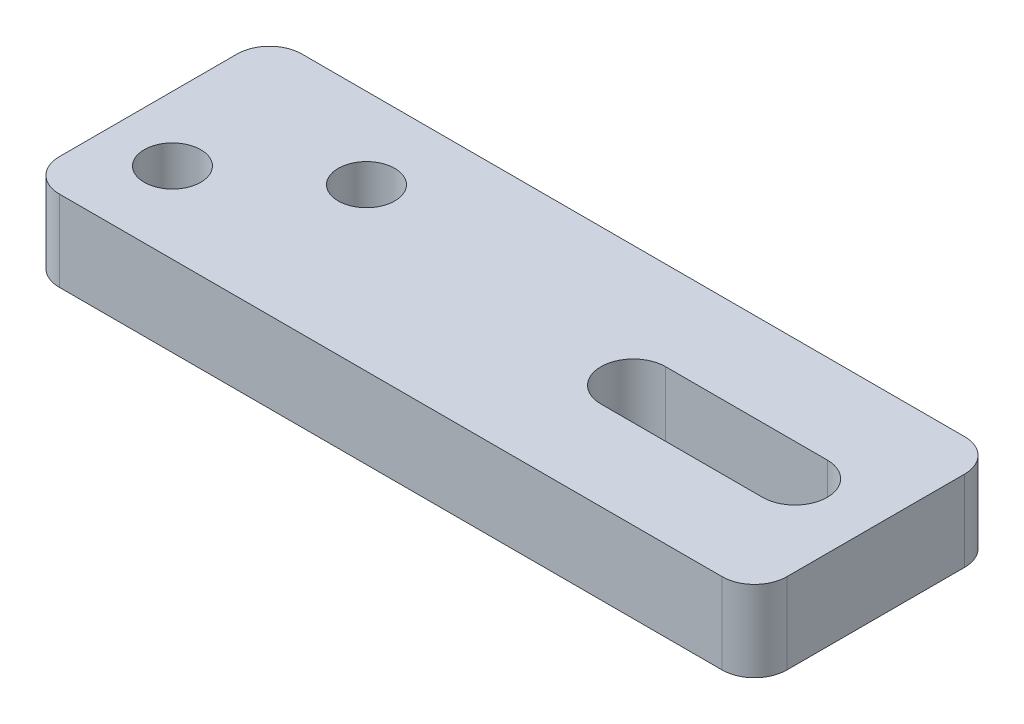
ISO-10303-21;
HEADER;
FILE_DESCRIPTION(('STEP AP214'),'2;1');
FILE_NAME('part.step','',(''),(''),'','','');
FILE_SCHEMA(('AUTOMOTIVE_DESIGN { 1 0 10303 214 1 1 1 1 }'));
ENDSEC;
DATA;
#1=APPLICATION_CONTEXT('core data for automotive mechanical design processes');
#2=APPLICATION_PROTOCOL_DEFINITION('international standard','automotive_design',2000,#1);
#3=PRODUCT_CONTEXT('',#1,'mechanical');
#4=PRODUCT('Part','Part','',(#3));
#5=PRODUCT_RELATED_PRODUCT_CATEGORY('part','',(#4));
#6=PRODUCT_DEFINITION_FORMATION('','',#4);
#7=PRODUCT_DEFINITION_CONTEXT('part definition',#1,'design');
#8=PRODUCT_DEFINITION('design','',#6,#7);
#9=PRODUCT_DEFINITION_SHAPE('','',#8);
#10=(LENGTH_UNIT() NAMED_UNIT(*) SI_UNIT(.MILLI.,.METRE.));
#11=(NAMED_UNIT(*) PLANE_ANGLE_UNIT() SI_UNIT($,.RADIAN.));
#12=(NAMED_UNIT(*) SI_UNIT($,.STERADIAN.) SOLID_ANGLE_UNIT());
#13=UNCERTAINTY_MEASURE_WITH_UNIT(LENGTH_MEASURE(1.E-05),#10,'distance_accuracy_value','');
#14=(GEOMETRIC_REPRESENTATION_CONTEXT(3) GLOBAL_UNCERTAINTY_ASSIGNED_CONTEXT((#13)) GLOBAL_UNIT_ASSIGNED_CONTEXT((#10,
#11,#12)) REPRESENTATION_CONTEXT('',''));
#15=CARTESIAN_POINT('',(0.,0.,0.));
#16=DIRECTION('',(0.,0.,1.));
#17=DIRECTION('',(1.,0.,0.));
#18=AXIS2_PLACEMENT_3D('',#15,#16,#17);
#19=CARTESIAN_POINT('',(0.,5.,7.49999999999999));
#20=DIRECTION('',(0.,0.,-1.));
#21=DIRECTION('',(-1.,0.,0.));
#22=AXIS2_PLACEMENT_3D('',#19,#20,#21);
#23=PLANE('',#22);
#24=DIRECTION('',(1.,0.,0.));
#25=VECTOR('',#24,1.);
#26=CARTESIAN_POINT('',(0.,0.,7.49999999999999));
#27=LINE('',#26,#25);
#28=CARTESIAN_POINT('',(2.,0.,7.49999999999999));
#29=VERTEX_POINT('',#28);
#30=CARTESIAN_POINT('',(43.,0.,7.50000000000001));
#31=VERTEX_POINT('',#30);
#32=EDGE_CURVE('E181',#29,#31,#27,.T.);
#33=ORIENTED_EDGE('',*,*,#32,.T.);
#34=DIRECTION('',(0.,-1.,0.));
#35=VECTOR('',#34,1.);
#36=CARTESIAN_POINT('',(43.,5.,7.50000000000001));
#37=LINE('',#36,#35);
#38=CARTESIAN_POINT('',(43.,5.,7.50000000000001));
#39=VERTEX_POINT('',#38);
#40=EDGE_CURVE('E11',#39,#31,#37,.T.);
#41=ORIENTED_EDGE('',*,*,#40,.F.);
#42=DIRECTION('',(1.,0.,0.));
#43=VECTOR('',#42,1.);
#44=CARTESIAN_POINT('',(0.,5.,7.49999999999999));
#45=LINE('',#44,#43);
#46=CARTESIAN_POINT('',(2.,5.,7.49999999999999));
#47=VERTEX_POINT('',#46);
#48=EDGE_CURVE('E246',#47,#39,#45,.T.);
#49=ORIENTED_EDGE('',*,*,#48,.F.);
#50=DIRECTION('',(0.,-1.,0.));
#51=VECTOR('',#50,1.);
#52=CARTESIAN_POINT('',(2.,5.,7.49999999999999));
#53=LINE('',#52,#51);
#54=EDGE_CURVE('E197',#47,#29,#53,.T.);
#55=ORIENTED_EDGE('',*,*,#54,.T.);
#56=EDGE_LOOP('',(#33,#41,#49,#55));
#57=FACE_BOUND('',#56,.T.);
#58=ADVANCED_FACE('F38',(#57),#23,.F.);
#59=CARTESIAN_POINT('',(43.,5.,5.50000000000001));
#60=DIRECTION('',(0.,-1.,0.));
#61=DIRECTION('',(0.,0.,-1.));
#62=AXIS2_PLACEMENT_3D('',#59,#60,#61);
#63=CYLINDRICAL_SURFACE('',#62,2.);
#64=CARTESIAN_POINT('',(43.,0.,5.50000000000001));
#65=DIRECTION('',(0.,1.,0.));
#66=DIRECTION('',(0.,0.,1.));
#67=AXIS2_PLACEMENT_3D('',#64,#65,#66);
#68=CIRCLE('',#67,2.);
#69=CARTESIAN_POINT('',(45.,0.,5.50000000000001));
#70=VERTEX_POINT('',#69);
#71=EDGE_CURVE('E184',#31,#70,#68,.T.);
#72=ORIENTED_EDGE('',*,*,#71,.T.);
#73=DIRECTION('',(0.,-1.,0.));
#74=VECTOR('',#73,1.);
#75=CARTESIAN_POINT('',(45.,5.,5.50000000000001));
#76=LINE('',#75,#74);
#77=CARTESIAN_POINT('',(45.,5.,5.50000000000001));
#78=VERTEX_POINT('',#77);
#79=EDGE_CURVE('E48',#78,#70,#76,.T.);
#80=ORIENTED_EDGE('',*,*,#79,.F.);
#81=CARTESIAN_POINT('',(43.,5.,5.50000000000001));
#82=DIRECTION('',(0.,1.,0.));
#83=DIRECTION('',(0.,0.,1.));
#84=AXIS2_PLACEMENT_3D('',#81,#82,#83);
#85=CIRCLE('',#84,2.);
#86=EDGE_CURVE('E248',#39,#78,#85,.T.);
#87=ORIENTED_EDGE('',*,*,#86,.F.);
#88=ORIENTED_EDGE('',*,*,#40,.T.);
#89=EDGE_LOOP('',(#72,#80,#87,#88));
#90=FACE_BOUND('',#89,.T.);
#91=ADVANCED_FACE('F280',(#90),#63,.T.);
#92=CARTESIAN_POINT('',(45.,5.,0.));
#93=DIRECTION('',(-1.,0.,0.));
#94=DIRECTION('',(0.,0.,1.));
#95=AXIS2_PLACEMENT_3D('',#92,#93,#94);
#96=PLANE('',#95);
#97=DIRECTION('',(0.,0.,-1.));
#98=VECTOR('',#97,1.);
#99=CARTESIAN_POINT('',(45.,0.,0.));
#100=LINE('',#99,#98);
#101=CARTESIAN_POINT('',(45.,0.,-5.50000000000001));
#102=VERTEX_POINT('',#101);
#103=EDGE_CURVE('E186',#70,#102,#100,.T.);
#104=ORIENTED_EDGE('',*,*,#103,.T.);
#105=DIRECTION('',(0.,-1.,0.));
#106=VECTOR('',#105,1.);
#107=CARTESIAN_POINT('',(45.,5.,-5.50000000000001));
#108=LINE('',#107,#106);
#109=CARTESIAN_POINT('',(45.,5.,-5.50000000000001));
#110=VERTEX_POINT('',#109);
#111=EDGE_CURVE('E204',#110,#102,#108,.T.);
#112=ORIENTED_EDGE('',*,*,#111,.F.);
#113=DIRECTION('',(0.,0.,-1.));
#114=VECTOR('',#113,1.);
#115=CARTESIAN_POINT('',(45.,5.,0.));
#116=LINE('',#115,#114);
#117=EDGE_CURVE('E250',#78,#110,#116,.T.);
#118=ORIENTED_EDGE('',*,*,#117,.F.);
#119=ORIENTED_EDGE('',*,*,#79,.T.);
#120=EDGE_LOOP('',(#104,#112,#118,#119));
#121=FACE_BOUND('',#120,.T.);
#122=ADVANCED_FACE('F285',(#121),#96,.F.);
#123=CARTESIAN_POINT('',(43.,5.,-5.50000000000001));
#124=DIRECTION('',(0.,-1.,0.));
#125=DIRECTION('',(0.,0.,-1.));
#126=AXIS2_PLACEMENT_3D('',#123,#124,#125);
#127=CYLINDRICAL_SURFACE('',#126,2.);
#128=CARTESIAN_POINT('',(43.,0.,-5.50000000000001));
#129=DIRECTION('',(0.,1.,0.));
#130=DIRECTION('',(0.,0.,1.));
#131=AXIS2_PLACEMENT_3D('',#128,#129,#130);
#132=CIRCLE('',#131,2.);
#133=CARTESIAN_POINT('',(43.,0.,-7.50000000000001));
#134=VERTEX_POINT('',#133);
#135=EDGE_CURVE('E188',#102,#134,#132,.T.);
#136=ORIENTED_EDGE('',*,*,#135,.T.);
#137=DIRECTION('',(0.,-1.,0.));
#138=VECTOR('',#137,1.);
#139=CARTESIAN_POINT('',(43.,5.,-7.50000000000001));
#140=LINE('',#139,#138);
#141=CARTESIAN_POINT('',(43.,5.,-7.50000000000001));
#142=VERTEX_POINT('',#141);
#143=EDGE_CURVE('E201',#142,#134,#140,.T.);
#144=ORIENTED_EDGE('',*,*,#143,.F.);
#145=CARTESIAN_POINT('',(43.,5.,-5.50000000000001));
#146=DIRECTION('',(0.,1.,0.));
#147=DIRECTION('',(0.,0.,1.));
#148=AXIS2_PLACEMENT_3D('',#145,#146,#147);
#149=CIRCLE('',#148,2.);
#150=EDGE_CURVE('E157',#110,#142,#149,.T.);
#151=ORIENTED_EDGE('',*,*,#150,.F.);
#152=ORIENTED_EDGE('',*,*,#111,.T.);
#153=EDGE_LOOP('',(#136,#144,#151,#152));
#154=FACE_BOUND('',#153,.T.);
#155=ADVANCED_FACE('F256',(#154),#127,.T.);
#156=CARTESIAN_POINT('',(0.,5.,-7.49999999999999));
#157=DIRECTION('',(0.,0.,1.));
#158=DIRECTION('',(1.,0.,0.));
#159=AXIS2_PLACEMENT_3D('',#156,#157,#158);
#160=PLANE('',#159);
#161=DIRECTION('',(-1.,0.,0.));
#162=VECTOR('',#161,1.);
#163=CARTESIAN_POINT('',(0.,0.,-7.49999999999999));
#164=LINE('',#163,#162);
#165=CARTESIAN_POINT('',(2.,0.,-7.49999999999999));
#166=VERTEX_POINT('',#165);
#167=EDGE_CURVE('E190',#134,#166,#164,.T.);
#168=ORIENTED_EDGE('',*,*,#167,.T.);
#169=DIRECTION('',(0.,-1.,0.));
#170=VECTOR('',#169,1.);
#171=CARTESIAN_POINT('',(2.,5.,-7.49999999999999));
#172=LINE('',#171,#170);
#173=CARTESIAN_POINT('',(2.,5.,-7.49999999999999));
#174=VERTEX_POINT('',#173);
#175=EDGE_CURVE('E146',#174,#166,#172,.T.);
#176=ORIENTED_EDGE('',*,*,#175,.F.);
#177=DIRECTION('',(-1.,0.,0.));
#178=VECTOR('',#177,1.);
#179=CARTESIAN_POINT('',(0.,5.,-7.49999999999999));
#180=LINE('',#179,#178);
#181=EDGE_CURVE('E154',#142,#174,#180,.T.);
#182=ORIENTED_EDGE('',*,*,#181,.F.);
#183=ORIENTED_EDGE('',*,*,#143,.T.);
#184=EDGE_LOOP('',(#168,#176,#182,#183));
#185=FACE_BOUND('',#184,.T.);
#186=ADVANCED_FACE('F260',(#185),#160,.F.);
#187=CARTESIAN_POINT('',(2.,5.,-5.5));
#188=DIRECTION('',(0.,-1.,0.));
#189=DIRECTION('',(0.,0.,-1.));
#190=AXIS2_PLACEMENT_3D('',#187,#188,#189);
#191=CYLINDRICAL_SURFACE('',#190,2.);
#192=CARTESIAN_POINT('',(2.,0.,-5.5));
#193=DIRECTION('',(0.,1.,0.));
#194=DIRECTION('',(0.,0.,1.));
#195=AXIS2_PLACEMENT_3D('',#192,#193,#194);
#196=CIRCLE('',#195,2.);
#197=CARTESIAN_POINT('',(0.,0.,-5.5));
#198=VERTEX_POINT('',#197);
#199=EDGE_CURVE('E145',#198,#166,#196,.F.);
#200=ORIENTED_EDGE('',*,*,#199,.F.);
#201=DIRECTION('',(0.,-1.,0.));
#202=VECTOR('',#201,1.);
#203=CARTESIAN_POINT('',(0.,5.,-5.5));
#204=LINE('',#203,#202);
#205=CARTESIAN_POINT('',(0.,5.,-5.5));
#206=VERTEX_POINT('',#205);
#207=EDGE_CURVE('E139',#206,#198,#204,.T.);
#208=ORIENTED_EDGE('',*,*,#207,.F.);
#209=CARTESIAN_POINT('',(2.,5.,-5.5));
#210=DIRECTION('',(0.,1.,0.));
#211=DIRECTION('',(0.,0.,1.));
#212=AXIS2_PLACEMENT_3D('',#209,#210,#211);
#213=CIRCLE('',#212,2.);
#214=EDGE_CURVE('E143',#206,#174,#213,.F.);
#215=ORIENTED_EDGE('',*,*,#214,.T.);
#216=ORIENTED_EDGE('',*,*,#175,.T.);
#217=EDGE_LOOP('',(#200,#208,#215,#216));
#218=FACE_BOUND('',#217,.T.);
#219=ADVANCED_FACE('F141',(#218),#191,.T.);
#220=CARTESIAN_POINT('',(0.,5.,0.));
#221=DIRECTION('',(1.,0.,0.));
#222=DIRECTION('',(0.,0.,-1.));
#223=AXIS2_PLACEMENT_3D('',#220,#221,#222);
#224=PLANE('',#223);
#225=DIRECTION('',(0.,0.,1.));
#226=VECTOR('',#225,1.);
#227=CARTESIAN_POINT('',(0.,0.,0.));
#228=LINE('',#227,#226);
#229=CARTESIAN_POINT('',(0.,0.,5.5));
#230=VERTEX_POINT('',#229);
#231=EDGE_CURVE('E97',#198,#230,#228,.T.);
#232=ORIENTED_EDGE('',*,*,#231,.T.);
#233=DIRECTION('',(0.,-1.,0.));
#234=VECTOR('',#233,1.);
#235=CARTESIAN_POINT('',(0.,5.,5.5));
#236=LINE('',#235,#234);
#237=CARTESIAN_POINT('',(0.,5.,5.5));
#238=VERTEX_POINT('',#237);
#239=EDGE_CURVE('E147',#238,#230,#236,.T.);
#240=ORIENTED_EDGE('',*,*,#239,.F.);
#241=DIRECTION('',(0.,0.,1.));
#242=VECTOR('',#241,1.);
#243=CARTESIAN_POINT('',(0.,5.,0.));
#244=LINE('',#243,#242);
#245=EDGE_CURVE('E149',#206,#238,#244,.T.);
#246=ORIENTED_EDGE('',*,*,#245,.F.);
#247=ORIENTED_EDGE('',*,*,#207,.T.);
#248=EDGE_LOOP('',(#232,#240,#246,#247));
#249=FACE_BOUND('',#248,.T.);
#250=ADVANCED_FACE('F150',(#249),#224,.F.);
#251=CARTESIAN_POINT('',(40.,5.,0.));
#252=DIRECTION('',(0.,-1.,0.));
#253=DIRECTION('',(0.,0.,-1.));
#254=AXIS2_PLACEMENT_3D('',#251,#252,#253);
#255=CYLINDRICAL_SURFACE('',#254,2.);
#256=CARTESIAN_POINT('',(40.,0.,0.));
#257=DIRECTION('',(0.,1.,0.));
#258=DIRECTION('',(0.,0.,1.));
#259=AXIS2_PLACEMENT_3D('',#256,#257,#258);
#260=CIRCLE('',#259,2.);
#261=CARTESIAN_POINT('',(40.,0.,2.));
#262=VERTEX_POINT('',#261);
#263=CARTESIAN_POINT('',(40.,0.,-2.));
#264=VERTEX_POINT('',#263);
#265=EDGE_CURVE('E163',#262,#264,#260,.T.);
#266=ORIENTED_EDGE('',*,*,#265,.F.);
#267=DIRECTION('',(0.,-1.,0.));
#268=VECTOR('',#267,1.);
#269=CARTESIAN_POINT('',(40.,5.,2.));
#270=LINE('',#269,#268);
#271=CARTESIAN_POINT('',(40.,5.,2.));
#272=VERTEX_POINT('',#271);
#273=EDGE_CURVE('E42',#272,#262,#270,.T.);
#274=ORIENTED_EDGE('',*,*,#273,.F.);
#275=CARTESIAN_POINT('',(40.,5.,0.));
#276=DIRECTION('',(0.,1.,0.));
#277=DIRECTION('',(0.,0.,1.));
#278=AXIS2_PLACEMENT_3D('',#275,#276,#277);
#279=CIRCLE('',#278,2.);
#280=CARTESIAN_POINT('',(40.,5.,-2.));
#281=VERTEX_POINT('',#280);
#282=EDGE_CURVE('E196',#272,#281,#279,.T.);
#283=ORIENTED_EDGE('',*,*,#282,.T.);
#284=DIRECTION('',(0.,-1.,0.));
#285=VECTOR('',#284,1.);
#286=CARTESIAN_POINT('',(40.,5.,-2.));
#287=LINE('',#286,#285);
#288=EDGE_CURVE('E162',#281,#264,#287,.T.);
#289=ORIENTED_EDGE('',*,*,#288,.T.);
#290=EDGE_LOOP('',(#266,#274,#283,#289));
#291=FACE_BOUND('',#290,.T.);
#292=ADVANCED_FACE('F40',(#291),#255,.F.);
#293=CARTESIAN_POINT('',(0.,5.,2.));
#294=DIRECTION('',(0.,0.,-1.));
#295=DIRECTION('',(-1.,0.,0.));
#296=AXIS2_PLACEMENT_3D('',#293,#294,#295);
#297=PLANE('',#296);
#298=DIRECTION('',(1.,0.,0.));
#299=VECTOR('',#298,1.);
#300=CARTESIAN_POINT('',(0.,0.,2.));
#301=LINE('',#300,#299);
#302=CARTESIAN_POINT('',(30.0280609515296,0.,2.));
#303=VERTEX_POINT('',#302);
#304=EDGE_CURVE('E166',#303,#262,#301,.T.);
#305=ORIENTED_EDGE('',*,*,#304,.F.);
#306=DIRECTION('',(0.,-1.,0.));
#307=VECTOR('',#306,1.);
#308=CARTESIAN_POINT('',(30.0280609515296,5.,2.));
#309=LINE('',#308,#307);
#310=CARTESIAN_POINT('',(30.0280609515296,5.,2.));
#311=VERTEX_POINT('',#310);
#312=EDGE_CURVE('E211',#311,#303,#309,.T.);
#313=ORIENTED_EDGE('',*,*,#312,.F.);
#314=DIRECTION('',(1.,0.,0.));
#315=VECTOR('',#314,1.);
#316=CARTESIAN_POINT('',(0.,5.,2.));
#317=LINE('',#316,#315);
#318=EDGE_CURVE('E220',#311,#272,#317,.T.);
#319=ORIENTED_EDGE('',*,*,#318,.T.);
#320=ORIENTED_EDGE('',*,*,#273,.T.);
#321=EDGE_LOOP('',(#305,#313,#319,#320));
#322=FACE_BOUND('',#321,.T.);
#323=ADVANCED_FACE('F218',(#322),#297,.T.);
#324=CARTESIAN_POINT('',(30.0000000019378,5.,0.000196863911852674));
#325=DIRECTION('',(0.,-1.,0.));
#326=DIRECTION('',(0.,0.,-1.));
#327=AXIS2_PLACEMENT_3D('',#324,#325,#326);
#328=CYLINDRICAL_SURFACE('',#327,2.);
#329=CARTESIAN_POINT('',(30.0000000019378,0.,0.000196863911852674));
#330=DIRECTION('',(0.,1.,0.));
#331=DIRECTION('',(0.,0.,1.));
#332=AXIS2_PLACEMENT_3D('',#329,#330,#331);
#333=CIRCLE('',#332,2.);
#334=CARTESIAN_POINT('',(29.9999802904958,0.,-1.99980313599101));
#335=VERTEX_POINT('',#334);
#336=EDGE_CURVE('E169',#335,#303,#333,.T.);
#337=ORIENTED_EDGE('',*,*,#336,.F.);
#338=DIRECTION('',(0.,-1.,0.));
#339=VECTOR('',#338,1.);
#340=CARTESIAN_POINT('',(29.9999802904958,5.,-1.99980313599101));
#341=LINE('',#340,#339);
#342=CARTESIAN_POINT('',(29.9999802904958,5.,-1.99980313599101));
#343=VERTEX_POINT('',#342);
#344=EDGE_CURVE('E210',#343,#335,#341,.T.);
#345=ORIENTED_EDGE('',*,*,#344,.F.);
#346=CARTESIAN_POINT('',(30.0000000019378,5.,0.000196863911852674));
#347=DIRECTION('',(0.,1.,0.));
#348=DIRECTION('',(0.,0.,1.));
#349=AXIS2_PLACEMENT_3D('',#346,#347,#348);
#350=CIRCLE('',#349,2.);
#351=EDGE_CURVE('E229',#343,#311,#350,.T.);
#352=ORIENTED_EDGE('',*,*,#351,.T.);
#353=ORIENTED_EDGE('',*,*,#312,.T.);
#354=EDGE_LOOP('',(#337,#345,#352,#353));
#355=FACE_BOUND('',#354,.T.);
#356=ADVANCED_FACE('F226',(#355),#328,.F.);
#357=CARTESIAN_POINT('',(11.,5.,-2.49999999999999));
#358=DIRECTION('',(0.,-1.,0.));
#359=DIRECTION('',(0.,0.,-1.));
#360=AXIS2_PLACEMENT_3D('',#357,#358,#359);
#361=CYLINDRICAL_SURFACE('',#360,1.75);
#362=CARTESIAN_POINT('',(11.,5.,-2.49999999999999));
#363=DIRECTION('',(0.,1.,0.));
#364=DIRECTION('',(0.,0.,1.));
#365=AXIS2_PLACEMENT_3D('',#362,#363,#364);
#366=CIRCLE('',#365,1.75);
#367=CARTESIAN_POINT('',(11.,5.,-0.749999999999992));
#368=VERTEX_POINT('',#367);
#369=EDGE_CURVE('E243',#368,#368,#366,.T.);
#370=ORIENTED_EDGE('',*,*,#369,.T.);
#371=EDGE_LOOP('',(#370));
#372=FACE_BOUND('',#371,.T.);
#373=CARTESIAN_POINT('',(11.,0.,-2.49999999999999));
#374=DIRECTION('',(0.,1.,0.));
#375=DIRECTION('',(0.,0.,1.));
#376=AXIS2_PLACEMENT_3D('',#373,#374,#375);
#377=CIRCLE('',#376,1.75);
#378=CARTESIAN_POINT('',(11.,0.,-0.749999999999992));
#379=VERTEX_POINT('',#378);
#380=EDGE_CURVE('E178',#379,#379,#377,.T.);
#381=ORIENTED_EDGE('',*,*,#380,.F.);
#382=EDGE_LOOP('',(#381));
#383=FACE_BOUND('',#382,.T.);
#384=ADVANCED_FACE('F290',(#372,#383),#361,.F.);
#385=CARTESIAN_POINT('',(4.,5.,2.50000000000001));
#386=DIRECTION('',(0.,-1.,0.));
#387=DIRECTION('',(0.,0.,-1.));
#388=AXIS2_PLACEMENT_3D('',#385,#386,#387);
#389=CYLINDRICAL_SURFACE('',#388,1.75);
#390=CARTESIAN_POINT('',(4.,5.,2.50000000000001));
#391=DIRECTION('',(0.,1.,0.));
#392=DIRECTION('',(0.,0.,1.));
#393=AXIS2_PLACEMENT_3D('',#390,#391,#392);
#394=CIRCLE('',#393,1.75);
#395=CARTESIAN_POINT('',(4.,5.,4.25000000000001));
#396=VERTEX_POINT('',#395);
#397=EDGE_CURVE('E234',#396,#396,#394,.T.);
#398=ORIENTED_EDGE('',*,*,#397,.T.);
#399=EDGE_LOOP('',(#398));
#400=FACE_BOUND('',#399,.T.);
#401=CARTESIAN_POINT('',(4.,0.,2.50000000000001));
#402=DIRECTION('',(0.,1.,0.));
#403=DIRECTION('',(0.,0.,1.));
#404=AXIS2_PLACEMENT_3D('',#401,#402,#403);
#405=CIRCLE('',#404,1.75);
#406=CARTESIAN_POINT('',(4.,0.,4.25000000000001));
#407=VERTEX_POINT('',#406);
#408=EDGE_CURVE('E175',#407,#407,#405,.T.);
#409=ORIENTED_EDGE('',*,*,#408,.F.);
#410=EDGE_LOOP('',(#409));
#411=FACE_BOUND('',#410,.T.);
#412=ADVANCED_FACE('F275',(#400,#411),#389,.F.);
#413=CARTESIAN_POINT('',(-3.93572220662277E-05,5.,-1.99921254474128));
#414=DIRECTION('',(-1.96863620939786E-05,0.,-0.999999999806224));
#415=DIRECTION('',(-0.999999999806224,0.,1.96863620939786E-05));
#416=AXIS2_PLACEMENT_3D('',#413,#414,#415);
#417=PLANE('',#416);
#418=DIRECTION('',(0.999999999806224,0.,-1.96863620939786E-05));
#419=VECTOR('',#418,1.);
#420=CARTESIAN_POINT('',(-3.93572220662277E-05,0.,-1.99921254474128));
#421=LINE('',#420,#419);
#422=EDGE_CURVE('E172',#335,#264,#421,.T.);
#423=ORIENTED_EDGE('',*,*,#422,.T.);
#424=ORIENTED_EDGE('',*,*,#288,.F.);
#425=DIRECTION('',(0.999999999806224,0.,-1.96863620939786E-05));
#426=VECTOR('',#425,1.);
#427=CARTESIAN_POINT('',(-3.93572220662277E-05,5.,-1.99921254474128));
#428=LINE('',#427,#426);
#429=EDGE_CURVE('E231',#343,#281,#428,.T.);
#430=ORIENTED_EDGE('',*,*,#429,.F.);
#431=ORIENTED_EDGE('',*,*,#344,.T.);
#432=EDGE_LOOP('',(#423,#424,#430,#431));
#433=FACE_BOUND('',#432,.T.);
#434=ADVANCED_FACE('F232',(#433),#417,.F.);
#435=CARTESIAN_POINT('',(2.,5.,5.5));
#436=DIRECTION('',(0.,-1.,0.));
#437=DIRECTION('',(0.,0.,-1.));
#438=AXIS2_PLACEMENT_3D('',#435,#436,#437);
#439=CYLINDRICAL_SURFACE('',#438,2.);
#440=CARTESIAN_POINT('',(2.,0.,5.5));
#441=DIRECTION('',(0.,1.,0.));
#442=DIRECTION('',(0.,0.,1.));
#443=AXIS2_PLACEMENT_3D('',#440,#441,#442);
#444=CIRCLE('',#443,2.);
#445=EDGE_CURVE('E103',#230,#29,#444,.T.);
#446=ORIENTED_EDGE('',*,*,#445,.T.);
#447=ORIENTED_EDGE('',*,*,#54,.F.);
#448=CARTESIAN_POINT('',(2.,5.,5.5));
#449=DIRECTION('',(0.,1.,0.));
#450=DIRECTION('',(0.,0.,1.));
#451=AXIS2_PLACEMENT_3D('',#448,#449,#450);
#452=CIRCLE('',#451,2.);
#453=EDGE_CURVE('E57',#238,#47,#452,.T.);
#454=ORIENTED_EDGE('',*,*,#453,.F.);
#455=ORIENTED_EDGE('',*,*,#239,.T.);
#456=EDGE_LOOP('',(#446,#447,#454,#455));
#457=FACE_BOUND('',#456,.T.);
#458=ADVANCED_FACE('F267',(#457),#439,.T.);
#459=CARTESIAN_POINT('',(0.,5.,0.));
#460=DIRECTION('',(0.,1.,0.));
#461=DIRECTION('',(0.,0.,1.));
#462=AXIS2_PLACEMENT_3D('',#459,#460,#461);
#463=PLANE('',#462);
#464=ORIENTED_EDGE('',*,*,#282,.F.);
#465=ORIENTED_EDGE('',*,*,#318,.F.);
#466=ORIENTED_EDGE('',*,*,#351,.F.);
#467=ORIENTED_EDGE('',*,*,#429,.T.);
#468=EDGE_LOOP('',(#464,#465,#466,#467));
#469=FACE_BOUND('',#468,.T.);
#470=ORIENTED_EDGE('',*,*,#397,.F.);
#471=EDGE_LOOP('',(#470));
#472=FACE_BOUND('',#471,.T.);
#473=ORIENTED_EDGE('',*,*,#369,.F.);
#474=EDGE_LOOP('',(#473));
#475=FACE_BOUND('',#474,.T.);
#476=ORIENTED_EDGE('',*,*,#48,.T.);
#477=ORIENTED_EDGE('',*,*,#86,.T.);
#478=ORIENTED_EDGE('',*,*,#117,.T.);
#479=ORIENTED_EDGE('',*,*,#150,.T.);
#480=ORIENTED_EDGE('',*,*,#181,.T.);
#481=ORIENTED_EDGE('',*,*,#214,.F.);
#482=ORIENTED_EDGE('',*,*,#245,.T.);
#483=ORIENTED_EDGE('',*,*,#453,.T.);
#484=EDGE_LOOP('',(#476,#477,#478,#479,#480,#481,#482,#483));
#485=FACE_BOUND('',#484,.T.);
#486=ADVANCED_FACE('F152',(#469,#472,#475,#485),#463,.T.);
#487=CARTESIAN_POINT('',(0.,0.,0.));
#488=DIRECTION('',(0.,1.,0.));
#489=DIRECTION('',(0.,0.,1.));
#490=AXIS2_PLACEMENT_3D('',#487,#488,#489);
#491=PLANE('',#490);
#492=ORIENTED_EDGE('',*,*,#265,.T.);
#493=ORIENTED_EDGE('',*,*,#422,.F.);
#494=ORIENTED_EDGE('',*,*,#336,.T.);
#495=ORIENTED_EDGE('',*,*,#304,.T.);
#496=EDGE_LOOP('',(#492,#493,#494,#495));
#497=FACE_BOUND('',#496,.T.);
#498=ORIENTED_EDGE('',*,*,#408,.T.);
#499=EDGE_LOOP('',(#498));
#500=FACE_BOUND('',#499,.T.);
#501=ORIENTED_EDGE('',*,*,#380,.T.);
#502=EDGE_LOOP('',(#501));
#503=FACE_BOUND('',#502,.T.);
#504=ORIENTED_EDGE('',*,*,#32,.F.);
#505=ORIENTED_EDGE('',*,*,#445,.F.);
#506=ORIENTED_EDGE('',*,*,#231,.F.);
#507=ORIENTED_EDGE('',*,*,#199,.T.);
#508=ORIENTED_EDGE('',*,*,#167,.F.);
#509=ORIENTED_EDGE('',*,*,#135,.F.);
#510=ORIENTED_EDGE('',*,*,#103,.F.);
#511=ORIENTED_EDGE('',*,*,#71,.F.);
#512=EDGE_LOOP('',(#504,#505,#506,#507,#508,#509,#510,#511));
#513=FACE_BOUND('',#512,.T.);
#514=ADVANCED_FACE('F224',(#497,#500,#503,#513),#491,.F.);
#515=CLOSED_SHELL('',(#58,#91,#122,#155,#186,#219,#250,#292,#323,#356,#384,#412,#434,#458,#486,#514));
#516=MANIFOLD_SOLID_BREP('B2',#515);
#517=ADVANCED_BREP_SHAPE_REPRESENTATION('',(#18,#516),#14);
#518=SHAPE_DEFINITION_REPRESENTATION(#9,#517);
ENDSEC;
END-ISO-10303-21;
